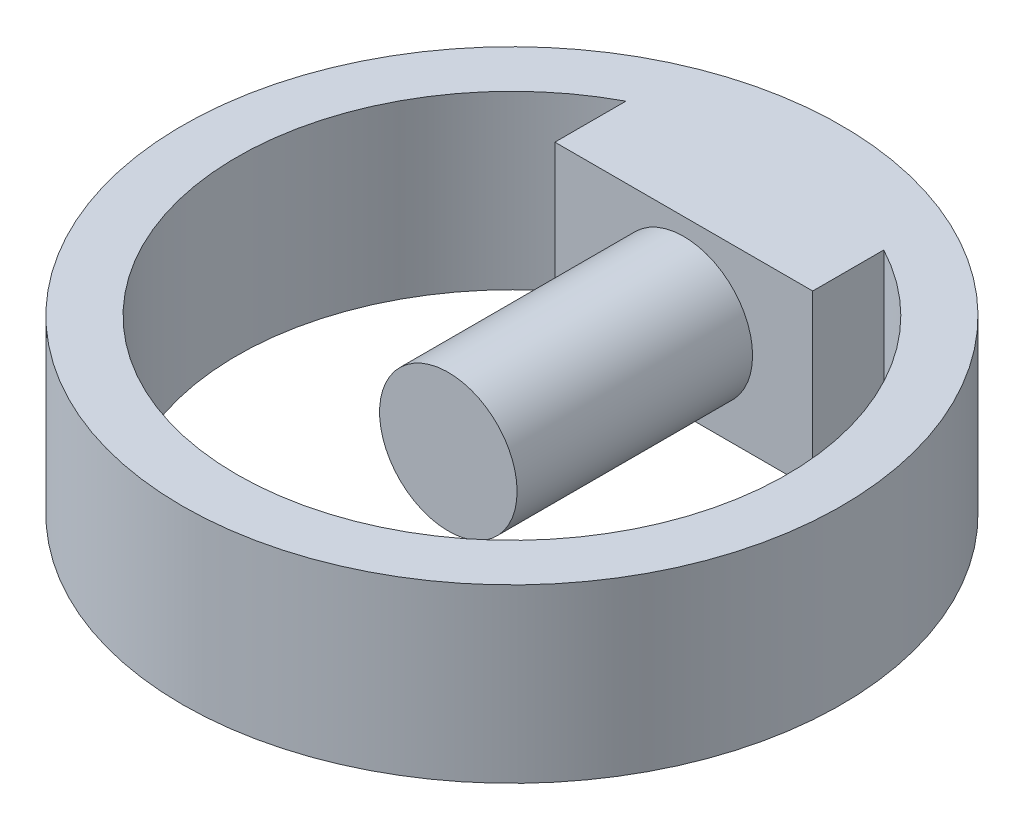
ISO-10303-21;
HEADER;
FILE_DESCRIPTION(('STEP AP214'),'2;1');
FILE_NAME('part.step','',(''),(''),'','','');
FILE_SCHEMA(('AUTOMOTIVE_DESIGN { 1 0 10303 214 1 1 1 1 }'));
ENDSEC;
DATA;
#1=APPLICATION_CONTEXT('core data for automotive mechanical design processes');
#2=APPLICATION_PROTOCOL_DEFINITION('international standard','automotive_design',2000,#1);
#3=PRODUCT_CONTEXT('',#1,'mechanical');
#4=PRODUCT('Part','Part','',(#3));
#5=PRODUCT_RELATED_PRODUCT_CATEGORY('part','',(#4));
#6=PRODUCT_DEFINITION_FORMATION('','',#4);
#7=PRODUCT_DEFINITION_CONTEXT('part definition',#1,'design');
#8=PRODUCT_DEFINITION('design','',#6,#7);
#9=PRODUCT_DEFINITION_SHAPE('','',#8);
#10=(LENGTH_UNIT() NAMED_UNIT(*) SI_UNIT(.MILLI.,.METRE.));
#11=(NAMED_UNIT(*) PLANE_ANGLE_UNIT() SI_UNIT($,.RADIAN.));
#12=(NAMED_UNIT(*) SI_UNIT($,.STERADIAN.) SOLID_ANGLE_UNIT());
#13=UNCERTAINTY_MEASURE_WITH_UNIT(LENGTH_MEASURE(1.E-05),#10,'distance_accuracy_value','');
#14=(GEOMETRIC_REPRESENTATION_CONTEXT(3) GLOBAL_UNCERTAINTY_ASSIGNED_CONTEXT((#13)) GLOBAL_UNIT_ASSIGNED_CONTEXT((#10,
#11,#12)) REPRESENTATION_CONTEXT('',''));
#15=CARTESIAN_POINT('',(0.,0.,0.));
#16=DIRECTION('',(0.,0.,1.));
#17=DIRECTION('',(1.,0.,0.));
#18=AXIS2_PLACEMENT_3D('',#15,#16,#17);
#19=CARTESIAN_POINT('',(0.,5.,0.));
#20=DIRECTION('',(0.,1.,0.));
#21=DIRECTION('',(0.,0.,1.));
#22=AXIS2_PLACEMENT_3D('',#19,#20,#21);
#23=PLANE('',#22);
#24=CARTESIAN_POINT('',(0.,5.,0.));
#25=DIRECTION('',(0.,1.,0.));
#26=DIRECTION('',(0.,0.,1.));
#27=AXIS2_PLACEMENT_3D('',#24,#25,#26);
#28=CIRCLE('',#27,19.175);
#29=CARTESIAN_POINT('',(0.,5.,19.175));
#30=VERTEX_POINT('',#29);
#31=EDGE_CURVE('E53',#30,#30,#28,.T.);
#32=ORIENTED_EDGE('',*,*,#31,.T.);
#33=EDGE_LOOP('',(#32));
#34=FACE_BOUND('',#33,.T.);
#35=CARTESIAN_POINT('',(0.,5.,0.));
#36=DIRECTION('',(0.,1.,0.));
#37=DIRECTION('',(0.,0.,1.));
#38=AXIS2_PLACEMENT_3D('',#35,#36,#37);
#39=CIRCLE('',#38,16.);
#40=CARTESIAN_POINT('',(-7.5,5.,-14.1332940251026));
#41=VERTEX_POINT('',#40);
#42=CARTESIAN_POINT('',(7.5,5.,-14.1332940251026));
#43=VERTEX_POINT('',#42);
#44=EDGE_CURVE('E82',#41,#43,#39,.T.);
#45=ORIENTED_EDGE('',*,*,#44,.F.);
#46=DIRECTION('',(0.,0.,1.));
#47=VECTOR('',#46,1.);
#48=CARTESIAN_POINT('',(-7.5,5.,-19.177));
#49=LINE('',#48,#47);
#50=CARTESIAN_POINT('',(-7.5,5.,-10.));
#51=VERTEX_POINT('',#50);
#52=EDGE_CURVE('E102',#41,#51,#49,.T.);
#53=ORIENTED_EDGE('',*,*,#52,.T.);
#54=DIRECTION('',(-1.,0.,0.));
#55=VECTOR('',#54,1.);
#56=CARTESIAN_POINT('',(-7.5,5.,-10.));
#57=LINE('',#56,#55);
#58=CARTESIAN_POINT('',(7.5,5.,-10.));
#59=VERTEX_POINT('',#58);
#60=EDGE_CURVE('E100',#59,#51,#57,.T.);
#61=ORIENTED_EDGE('',*,*,#60,.F.);
#62=DIRECTION('',(0.,0.,1.));
#63=VECTOR('',#62,1.);
#64=CARTESIAN_POINT('',(7.5,5.,-19.177));
#65=LINE('',#64,#63);
#66=EDGE_CURVE('E95',#43,#59,#65,.T.);
#67=ORIENTED_EDGE('',*,*,#66,.F.);
#68=EDGE_LOOP('',(#45,#53,#61,#67));
#69=FACE_BOUND('',#68,.T.);
#70=ADVANCED_FACE('F45',(#34,#69),#23,.T.);
#71=CARTESIAN_POINT('',(0.,-5.,0.));
#72=DIRECTION('',(0.,1.,0.));
#73=DIRECTION('',(0.,0.,1.));
#74=AXIS2_PLACEMENT_3D('',#71,#72,#73);
#75=PLANE('',#74);
#76=CARTESIAN_POINT('',(0.,-5.,0.));
#77=DIRECTION('',(0.,1.,0.));
#78=DIRECTION('',(0.,0.,1.));
#79=AXIS2_PLACEMENT_3D('',#76,#77,#78);
#80=CIRCLE('',#79,19.175);
#81=CARTESIAN_POINT('',(0.,-5.,19.175));
#82=VERTEX_POINT('',#81);
#83=EDGE_CURVE('E89',#82,#82,#80,.T.);
#84=ORIENTED_EDGE('',*,*,#83,.F.);
#85=EDGE_LOOP('',(#84));
#86=FACE_BOUND('',#85,.T.);
#87=CARTESIAN_POINT('',(0.,-5.,0.));
#88=DIRECTION('',(0.,1.,0.));
#89=DIRECTION('',(0.,0.,1.));
#90=AXIS2_PLACEMENT_3D('',#87,#88,#89);
#91=CIRCLE('',#90,16.);
#92=CARTESIAN_POINT('',(-7.5,-5.,-14.1332940251026));
#93=VERTEX_POINT('',#92);
#94=CARTESIAN_POINT('',(7.5,-5.,-14.1332940251026));
#95=VERTEX_POINT('',#94);
#96=EDGE_CURVE('E60',#93,#95,#91,.T.);
#97=ORIENTED_EDGE('',*,*,#96,.T.);
#98=DIRECTION('',(0.,0.,1.));
#99=VECTOR('',#98,1.);
#100=CARTESIAN_POINT('',(7.5,-5.,-19.177));
#101=LINE('',#100,#99);
#102=CARTESIAN_POINT('',(7.5,-5.,-10.));
#103=VERTEX_POINT('',#102);
#104=EDGE_CURVE('E97',#95,#103,#101,.T.);
#105=ORIENTED_EDGE('',*,*,#104,.T.);
#106=DIRECTION('',(1.,0.,0.));
#107=VECTOR('',#106,1.);
#108=CARTESIAN_POINT('',(-7.5,-5.,-10.));
#109=LINE('',#108,#107);
#110=CARTESIAN_POINT('',(-7.5,-5.,-10.));
#111=VERTEX_POINT('',#110);
#112=EDGE_CURVE('E107',#111,#103,#109,.T.);
#113=ORIENTED_EDGE('',*,*,#112,.F.);
#114=DIRECTION('',(0.,0.,1.));
#115=VECTOR('',#114,1.);
#116=CARTESIAN_POINT('',(-7.5,-5.,-19.177));
#117=LINE('',#116,#115);
#118=EDGE_CURVE('E104',#93,#111,#117,.T.);
#119=ORIENTED_EDGE('',*,*,#118,.F.);
#120=EDGE_LOOP('',(#97,#105,#113,#119));
#121=FACE_BOUND('',#120,.T.);
#122=ADVANCED_FACE('F125',(#86,#121),#75,.F.);
#123=CARTESIAN_POINT('',(0.,5.,0.));
#124=DIRECTION('',(0.,-1.,0.));
#125=DIRECTION('',(0.,0.,-1.));
#126=AXIS2_PLACEMENT_3D('',#123,#124,#125);
#127=CYLINDRICAL_SURFACE('',#126,19.175);
#128=ORIENTED_EDGE('',*,*,#31,.F.);
#129=EDGE_LOOP('',(#128));
#130=FACE_BOUND('',#129,.T.);
#131=ORIENTED_EDGE('',*,*,#83,.T.);
#132=EDGE_LOOP('',(#131));
#133=FACE_BOUND('',#132,.T.);
#134=ADVANCED_FACE('F47',(#130,#133),#127,.T.);
#135=CARTESIAN_POINT('',(0.,5.,0.));
#136=DIRECTION('',(0.,-1.,0.));
#137=DIRECTION('',(0.,0.,-1.));
#138=AXIS2_PLACEMENT_3D('',#135,#136,#137);
#139=CYLINDRICAL_SURFACE('',#138,16.);
#140=DIRECTION('',(0.,-1.,0.));
#141=VECTOR('',#140,1.);
#142=CARTESIAN_POINT('',(-7.5,5.,-14.1332940251026));
#143=LINE('',#142,#141);
#144=EDGE_CURVE('E84',#93,#41,#143,.F.);
#145=ORIENTED_EDGE('',*,*,#144,.T.);
#146=ORIENTED_EDGE('',*,*,#44,.T.);
#147=DIRECTION('',(0.,-1.,0.));
#148=VECTOR('',#147,1.);
#149=CARTESIAN_POINT('',(7.5,5.,-14.1332940251026));
#150=LINE('',#149,#148);
#151=EDGE_CURVE('E65',#43,#95,#150,.T.);
#152=ORIENTED_EDGE('',*,*,#151,.T.);
#153=ORIENTED_EDGE('',*,*,#96,.F.);
#154=EDGE_LOOP('',(#145,#146,#152,#153));
#155=FACE_BOUND('',#154,.T.);
#156=ADVANCED_FACE('F83',(#155),#139,.F.);
#157=CARTESIAN_POINT('',(-7.5,5.,-19.177));
#158=DIRECTION('',(-1.,0.,0.));
#159=DIRECTION('',(0.,0.,1.));
#160=AXIS2_PLACEMENT_3D('',#157,#158,#159);
#161=PLANE('',#160);
#162=ORIENTED_EDGE('',*,*,#144,.F.);
#163=ORIENTED_EDGE('',*,*,#118,.T.);
#164=DIRECTION('',(0.,-1.,0.));
#165=VECTOR('',#164,1.);
#166=CARTESIAN_POINT('',(-7.5,5.,-10.));
#167=LINE('',#166,#165);
#168=EDGE_CURVE('E135',#51,#111,#167,.T.);
#169=ORIENTED_EDGE('',*,*,#168,.F.);
#170=ORIENTED_EDGE('',*,*,#52,.F.);
#171=EDGE_LOOP('',(#162,#163,#169,#170));
#172=FACE_BOUND('',#171,.T.);
#173=ADVANCED_FACE('F134',(#172),#161,.T.);
#174=CARTESIAN_POINT('',(7.5,5.,-19.177));
#175=DIRECTION('',(1.,0.,0.));
#176=DIRECTION('',(0.,0.,-1.));
#177=AXIS2_PLACEMENT_3D('',#174,#175,#176);
#178=PLANE('',#177);
#179=ORIENTED_EDGE('',*,*,#151,.F.);
#180=ORIENTED_EDGE('',*,*,#66,.T.);
#181=DIRECTION('',(0.,1.,0.));
#182=VECTOR('',#181,1.);
#183=CARTESIAN_POINT('',(7.5,5.,-10.));
#184=LINE('',#183,#182);
#185=EDGE_CURVE('E116',#103,#59,#184,.T.);
#186=ORIENTED_EDGE('',*,*,#185,.F.);
#187=ORIENTED_EDGE('',*,*,#104,.F.);
#188=EDGE_LOOP('',(#179,#180,#186,#187));
#189=FACE_BOUND('',#188,.T.);
#190=ADVANCED_FACE('F93',(#189),#178,.T.);
#191=CARTESIAN_POINT('',(0.,0.,-10.));
#192=DIRECTION('',(0.,0.,1.));
#193=DIRECTION('',(1.,0.,0.));
#194=AXIS2_PLACEMENT_3D('',#191,#192,#193);
#195=PLANE('',#194);
#196=CARTESIAN_POINT('',(0.,0.,-10.));
#197=DIRECTION('',(0.,0.,1.));
#198=DIRECTION('',(1.,0.,0.));
#199=AXIS2_PLACEMENT_3D('',#196,#197,#198);
#200=CIRCLE('',#199,4.);
#201=CARTESIAN_POINT('',(4.,0.,-10.));
#202=VERTEX_POINT('',#201);
#203=EDGE_CURVE('E11',#202,#202,#200,.F.);
#204=ORIENTED_EDGE('',*,*,#203,.T.);
#205=EDGE_LOOP('',(#204));
#206=FACE_BOUND('',#205,.T.);
#207=ORIENTED_EDGE('',*,*,#185,.T.);
#208=ORIENTED_EDGE('',*,*,#60,.T.);
#209=ORIENTED_EDGE('',*,*,#168,.T.);
#210=ORIENTED_EDGE('',*,*,#112,.T.);
#211=EDGE_LOOP('',(#207,#208,#209,#210));
#212=FACE_BOUND('',#211,.T.);
#213=ADVANCED_FACE('F137',(#206,#212),#195,.T.);
#214=CARTESIAN_POINT('',(0.,0.,3.7));
#215=DIRECTION('',(0.,0.,1.));
#216=DIRECTION('',(1.,0.,0.));
#217=AXIS2_PLACEMENT_3D('',#214,#215,#216);
#218=PLANE('',#217);
#219=CARTESIAN_POINT('',(0.,0.,3.7));
#220=DIRECTION('',(0.,0.,1.));
#221=DIRECTION('',(1.,0.,0.));
#222=AXIS2_PLACEMENT_3D('',#219,#220,#221);
#223=CIRCLE('',#222,4.);
#224=CARTESIAN_POINT('',(4.,0.,3.7));
#225=VERTEX_POINT('',#224);
#226=EDGE_CURVE('E113',#225,#225,#223,.T.);
#227=ORIENTED_EDGE('',*,*,#226,.T.);
#228=EDGE_LOOP('',(#227));
#229=FACE_BOUND('',#228,.T.);
#230=ADVANCED_FACE('F141',(#229),#218,.T.);
#231=CARTESIAN_POINT('',(0.,0.,-19.177));
#232=DIRECTION('',(0.,0.,1.));
#233=DIRECTION('',(1.,0.,0.));
#234=AXIS2_PLACEMENT_3D('',#231,#232,#233);
#235=CYLINDRICAL_SURFACE('',#234,4.);
#236=ORIENTED_EDGE('',*,*,#203,.F.);
#237=EDGE_LOOP('',(#236));
#238=FACE_BOUND('',#237,.T.);
#239=ORIENTED_EDGE('',*,*,#226,.F.);
#240=EDGE_LOOP('',(#239));
#241=FACE_BOUND('',#240,.T.);
#242=ADVANCED_FACE('F149',(#238,#241),#235,.T.);
#243=CLOSED_SHELL('',(#70,#122,#134,#156,#173,#190,#213,#230,#242));
#244=MANIFOLD_SOLID_BREP('B2',#243);
#245=ADVANCED_BREP_SHAPE_REPRESENTATION('',(#18,#244),#14);
#246=SHAPE_DEFINITION_REPRESENTATION(#9,#245);
ENDSEC;
END-ISO-10303-21;
